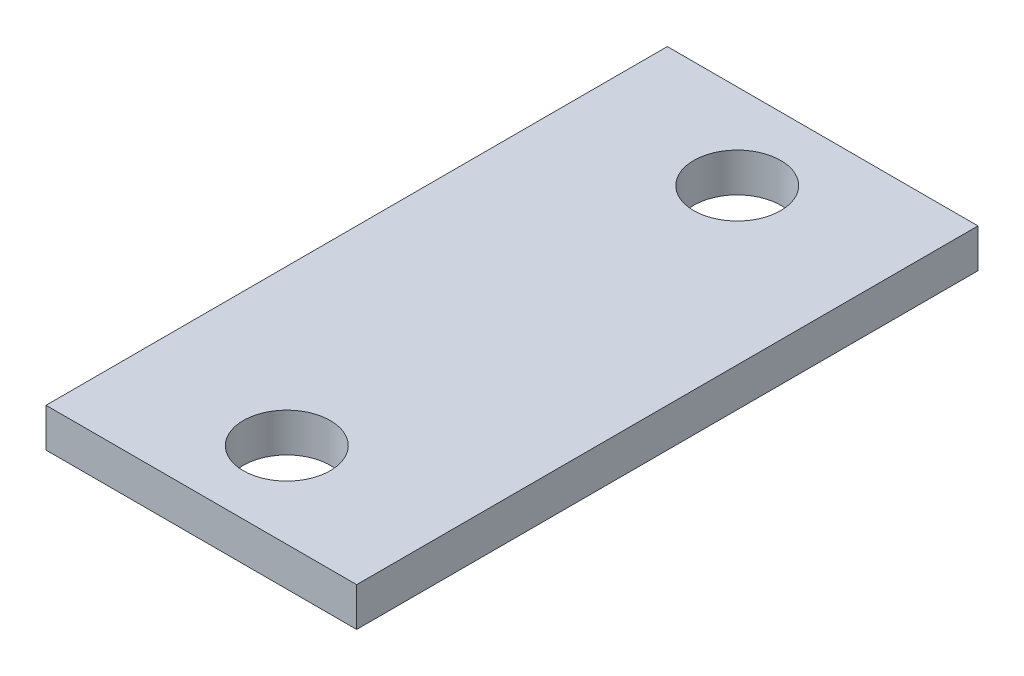
ISO-10303-21;
HEADER;
FILE_DESCRIPTION(('STEP AP214'),'2;1');
FILE_NAME('part.step','',(''),(''),'','','');
FILE_SCHEMA(('AUTOMOTIVE_DESIGN { 1 0 10303 214 1 1 1 1 }'));
ENDSEC;
DATA;
#1=APPLICATION_CONTEXT('core data for automotive mechanical design processes');
#2=APPLICATION_PROTOCOL_DEFINITION('international standard','automotive_design',2000,#1);
#3=PRODUCT_CONTEXT('',#1,'mechanical');
#4=PRODUCT('Part','Part','',(#3));
#5=PRODUCT_RELATED_PRODUCT_CATEGORY('part','',(#4));
#6=PRODUCT_DEFINITION_FORMATION('','',#4);
#7=PRODUCT_DEFINITION_CONTEXT('part definition',#1,'design');
#8=PRODUCT_DEFINITION('design','',#6,#7);
#9=PRODUCT_DEFINITION_SHAPE('','',#8);
#10=(LENGTH_UNIT() NAMED_UNIT(*) SI_UNIT(.MILLI.,.METRE.));
#11=(NAMED_UNIT(*) PLANE_ANGLE_UNIT() SI_UNIT($,.RADIAN.));
#12=(NAMED_UNIT(*) SI_UNIT($,.STERADIAN.) SOLID_ANGLE_UNIT());
#13=UNCERTAINTY_MEASURE_WITH_UNIT(LENGTH_MEASURE(1.E-05),#10,'distance_accuracy_value','');
#14=(GEOMETRIC_REPRESENTATION_CONTEXT(3) GLOBAL_UNCERTAINTY_ASSIGNED_CONTEXT((#13)) GLOBAL_UNIT_ASSIGNED_CONTEXT((#10,
#11,#12)) REPRESENTATION_CONTEXT('',''));
#15=CARTESIAN_POINT('',(0.,0.,0.));
#16=DIRECTION('',(0.,0.,1.));
#17=DIRECTION('',(1.,0.,0.));
#18=AXIS2_PLACEMENT_3D('',#15,#16,#17);
#19=CARTESIAN_POINT('',(0.,6.35000000000002,0.));
#20=DIRECTION('',(0.,-0.999999999999998,0.));
#21=DIRECTION('',(0.,0.,-1.));
#22=AXIS2_PLACEMENT_3D('',#19,#20,#21);
#23=PLANE('',#22);
#24=DIRECTION('',(0.,0.,1.));
#25=VECTOR('',#24,1.);
#26=CARTESIAN_POINT('',(0.,6.35000000000002,0.));
#27=LINE('',#26,#25);
#28=CARTESIAN_POINT('',(0.,6.35000000000002,-101.6));
#29=VERTEX_POINT('',#28);
#30=CARTESIAN_POINT('',(0.,6.35000000000002,0.));
#31=VERTEX_POINT('',#30);
#32=EDGE_CURVE('E94',#29,#31,#27,.T.);
#33=ORIENTED_EDGE('',*,*,#32,.T.);
#34=DIRECTION('',(1.,0.,0.));
#35=VECTOR('',#34,1.);
#36=CARTESIAN_POINT('',(0.,6.35000000000002,0.));
#37=LINE('',#36,#35);
#38=CARTESIAN_POINT('',(50.8,6.35000000000002,0.));
#39=VERTEX_POINT('',#38);
#40=EDGE_CURVE('E89',#31,#39,#37,.T.);
#41=ORIENTED_EDGE('',*,*,#40,.T.);
#42=DIRECTION('',(0.,0.,-1.));
#43=VECTOR('',#42,1.);
#44=CARTESIAN_POINT('',(50.8,6.35000000000002,0.));
#45=LINE('',#44,#43);
#46=CARTESIAN_POINT('',(50.8,6.35000000000002,-101.6));
#47=VERTEX_POINT('',#46);
#48=EDGE_CURVE('E92',#39,#47,#45,.T.);
#49=ORIENTED_EDGE('',*,*,#48,.T.);
#50=DIRECTION('',(-1.,0.,0.));
#51=VECTOR('',#50,1.);
#52=CARTESIAN_POINT('',(0.,6.35000000000002,-101.6));
#53=LINE('',#52,#51);
#54=EDGE_CURVE('E59',#47,#29,#53,.T.);
#55=ORIENTED_EDGE('',*,*,#54,.T.);
#56=EDGE_LOOP('',(#33,#41,#49,#55));
#57=FACE_BOUND('',#56,.T.);
#58=CARTESIAN_POINT('',(25.4,6.35000000000002,-13.97));
#59=DIRECTION('',(0.,0.999999999999998,0.));
#60=DIRECTION('',(0.,0.,1.));
#61=AXIS2_PLACEMENT_3D('',#58,#59,#60);
#62=CIRCLE('',#61,7.112);
#63=CARTESIAN_POINT('',(25.4,6.35000000000002,-6.85799999999998));
#64=VERTEX_POINT('',#63);
#65=EDGE_CURVE('E109',#64,#64,#62,.T.);
#66=ORIENTED_EDGE('',*,*,#65,.F.);
#67=EDGE_LOOP('',(#66));
#68=FACE_BOUND('',#67,.T.);
#69=CARTESIAN_POINT('',(25.4,6.35000000000002,-87.63));
#70=DIRECTION('',(0.,0.999999999999998,0.));
#71=DIRECTION('',(0.,0.,1.));
#72=AXIS2_PLACEMENT_3D('',#69,#70,#71);
#73=CIRCLE('',#72,7.112);
#74=CARTESIAN_POINT('',(25.4,6.35000000000002,-80.518));
#75=VERTEX_POINT('',#74);
#76=EDGE_CURVE('E124',#75,#75,#73,.T.);
#77=ORIENTED_EDGE('',*,*,#76,.F.);
#78=EDGE_LOOP('',(#77));
#79=FACE_BOUND('',#78,.T.);
#80=ADVANCED_FACE('F42',(#57,#68,#79),#23,.F.);
#81=CARTESIAN_POINT('',(0.,0.,0.));
#82=DIRECTION('',(0.,-0.999999999999998,0.));
#83=DIRECTION('',(0.,0.,-1.));
#84=AXIS2_PLACEMENT_3D('',#81,#82,#83);
#85=PLANE('',#84);
#86=CARTESIAN_POINT('',(25.4,0.,-13.97));
#87=DIRECTION('',(0.,0.999999999999998,0.));
#88=DIRECTION('',(0.,0.,1.));
#89=AXIS2_PLACEMENT_3D('',#86,#87,#88);
#90=CIRCLE('',#89,7.112);
#91=CARTESIAN_POINT('',(25.4,0.,-6.85799999999998));
#92=VERTEX_POINT('',#91);
#93=EDGE_CURVE('E121',#92,#92,#90,.T.);
#94=ORIENTED_EDGE('',*,*,#93,.T.);
#95=EDGE_LOOP('',(#94));
#96=FACE_BOUND('',#95,.T.);
#97=DIRECTION('',(0.,0.,1.));
#98=VECTOR('',#97,1.);
#99=CARTESIAN_POINT('',(0.,0.,0.));
#100=LINE('',#99,#98);
#101=CARTESIAN_POINT('',(0.,0.,-101.6));
#102=VERTEX_POINT('',#101);
#103=CARTESIAN_POINT('',(0.,0.,0.));
#104=VERTEX_POINT('',#103);
#105=EDGE_CURVE('E106',#102,#104,#100,.T.);
#106=ORIENTED_EDGE('',*,*,#105,.F.);
#107=DIRECTION('',(-1.,0.,0.));
#108=VECTOR('',#107,1.);
#109=CARTESIAN_POINT('',(0.,0.,-101.6));
#110=LINE('',#109,#108);
#111=CARTESIAN_POINT('',(50.8,0.,-101.6));
#112=VERTEX_POINT('',#111);
#113=EDGE_CURVE('E82',#112,#102,#110,.T.);
#114=ORIENTED_EDGE('',*,*,#113,.F.);
#115=DIRECTION('',(0.,0.,-1.));
#116=VECTOR('',#115,1.);
#117=CARTESIAN_POINT('',(50.8,0.,0.));
#118=LINE('',#117,#116);
#119=CARTESIAN_POINT('',(50.8,0.,0.));
#120=VERTEX_POINT('',#119);
#121=EDGE_CURVE('E76',#120,#112,#118,.T.);
#122=ORIENTED_EDGE('',*,*,#121,.F.);
#123=DIRECTION('',(1.,0.,0.));
#124=VECTOR('',#123,1.);
#125=CARTESIAN_POINT('',(0.,0.,0.));
#126=LINE('',#125,#124);
#127=EDGE_CURVE('E98',#104,#120,#126,.T.);
#128=ORIENTED_EDGE('',*,*,#127,.F.);
#129=EDGE_LOOP('',(#106,#114,#122,#128));
#130=FACE_BOUND('',#129,.T.);
#131=CARTESIAN_POINT('',(25.4,0.,-87.63));
#132=DIRECTION('',(0.,0.999999999999998,0.));
#133=DIRECTION('',(0.,0.,1.));
#134=AXIS2_PLACEMENT_3D('',#131,#132,#133);
#135=CIRCLE('',#134,7.112);
#136=CARTESIAN_POINT('',(25.4,0.,-80.518));
#137=VERTEX_POINT('',#136);
#138=EDGE_CURVE('E127',#137,#137,#135,.T.);
#139=ORIENTED_EDGE('',*,*,#138,.T.);
#140=EDGE_LOOP('',(#139));
#141=FACE_BOUND('',#140,.T.);
#142=ADVANCED_FACE('F117',(#96,#130,#141),#85,.T.);
#143=CARTESIAN_POINT('',(0.,6.35000000000002,0.));
#144=DIRECTION('',(1.,0.,0.));
#145=DIRECTION('',(0.,0.,-1.));
#146=AXIS2_PLACEMENT_3D('',#143,#144,#145);
#147=PLANE('',#146);
#148=ORIENTED_EDGE('',*,*,#105,.T.);
#149=DIRECTION('',(0.,-0.999999999999998,0.));
#150=VECTOR('',#149,1.);
#151=CARTESIAN_POINT('',(0.,6.35000000000002,0.));
#152=LINE('',#151,#150);
#153=EDGE_CURVE('E13',#31,#104,#152,.T.);
#154=ORIENTED_EDGE('',*,*,#153,.F.);
#155=ORIENTED_EDGE('',*,*,#32,.F.);
#156=DIRECTION('',(0.,-0.999999999999998,0.));
#157=VECTOR('',#156,1.);
#158=CARTESIAN_POINT('',(0.,6.35000000000002,-101.6));
#159=LINE('',#158,#157);
#160=EDGE_CURVE('E102',#29,#102,#159,.T.);
#161=ORIENTED_EDGE('',*,*,#160,.T.);
#162=EDGE_LOOP('',(#148,#154,#155,#161));
#163=FACE_BOUND('',#162,.T.);
#164=ADVANCED_FACE('F44',(#163),#147,.F.);
#165=CARTESIAN_POINT('',(0.,6.35000000000002,0.));
#166=DIRECTION('',(0.,0.,-1.));
#167=DIRECTION('',(-1.,0.,0.));
#168=AXIS2_PLACEMENT_3D('',#165,#166,#167);
#169=PLANE('',#168);
#170=ORIENTED_EDGE('',*,*,#127,.T.);
#171=DIRECTION('',(0.,-0.999999999999998,0.));
#172=VECTOR('',#171,1.);
#173=CARTESIAN_POINT('',(50.8,6.35000000000002,0.));
#174=LINE('',#173,#172);
#175=EDGE_CURVE('E51',#39,#120,#174,.T.);
#176=ORIENTED_EDGE('',*,*,#175,.F.);
#177=ORIENTED_EDGE('',*,*,#40,.F.);
#178=ORIENTED_EDGE('',*,*,#153,.T.);
#179=EDGE_LOOP('',(#170,#176,#177,#178));
#180=FACE_BOUND('',#179,.T.);
#181=ADVANCED_FACE('F97',(#180),#169,.F.);
#182=CARTESIAN_POINT('',(50.8,6.35000000000002,0.));
#183=DIRECTION('',(-1.,0.,0.));
#184=DIRECTION('',(0.,0.,1.));
#185=AXIS2_PLACEMENT_3D('',#182,#183,#184);
#186=PLANE('',#185);
#187=ORIENTED_EDGE('',*,*,#121,.T.);
#188=DIRECTION('',(0.,-0.999999999999998,0.));
#189=VECTOR('',#188,1.);
#190=CARTESIAN_POINT('',(50.8,6.35000000000002,-101.6));
#191=LINE('',#190,#189);
#192=EDGE_CURVE('E99',#47,#112,#191,.T.);
#193=ORIENTED_EDGE('',*,*,#192,.F.);
#194=ORIENTED_EDGE('',*,*,#48,.F.);
#195=ORIENTED_EDGE('',*,*,#175,.T.);
#196=EDGE_LOOP('',(#187,#193,#194,#195));
#197=FACE_BOUND('',#196,.T.);
#198=ADVANCED_FACE('F100',(#197),#186,.F.);
#199=CARTESIAN_POINT('',(0.,6.35000000000002,-101.6));
#200=DIRECTION('',(0.,0.,1.));
#201=DIRECTION('',(1.,0.,0.));
#202=AXIS2_PLACEMENT_3D('',#199,#200,#201);
#203=PLANE('',#202);
#204=ORIENTED_EDGE('',*,*,#113,.T.);
#205=ORIENTED_EDGE('',*,*,#160,.F.);
#206=ORIENTED_EDGE('',*,*,#54,.F.);
#207=ORIENTED_EDGE('',*,*,#192,.T.);
#208=EDGE_LOOP('',(#204,#205,#206,#207));
#209=FACE_BOUND('',#208,.T.);
#210=ADVANCED_FACE('F114',(#209),#203,.F.);
#211=CARTESIAN_POINT('',(25.4,6.35000000000002,-13.97));
#212=DIRECTION('',(0.,-0.999999999999998,0.));
#213=DIRECTION('',(0.,0.,-1.));
#214=AXIS2_PLACEMENT_3D('',#211,#212,#213);
#215=CYLINDRICAL_SURFACE('',#214,7.112);
#216=ORIENTED_EDGE('',*,*,#65,.T.);
#217=EDGE_LOOP('',(#216));
#218=FACE_BOUND('',#217,.T.);
#219=ORIENTED_EDGE('',*,*,#93,.F.);
#220=EDGE_LOOP('',(#219));
#221=FACE_BOUND('',#220,.T.);
#222=ADVANCED_FACE('F144',(#218,#221),#215,.F.);
#223=CARTESIAN_POINT('',(25.4,6.35000000000002,-87.63));
#224=DIRECTION('',(0.,-0.999999999999998,0.));
#225=DIRECTION('',(0.,0.,-1.));
#226=AXIS2_PLACEMENT_3D('',#223,#224,#225);
#227=CYLINDRICAL_SURFACE('',#226,7.112);
#228=ORIENTED_EDGE('',*,*,#76,.T.);
#229=EDGE_LOOP('',(#228));
#230=FACE_BOUND('',#229,.T.);
#231=ORIENTED_EDGE('',*,*,#138,.F.);
#232=EDGE_LOOP('',(#231));
#233=FACE_BOUND('',#232,.T.);
#234=ADVANCED_FACE('F133',(#230,#233),#227,.F.);
#235=CLOSED_SHELL('',(#80,#142,#164,#181,#198,#210,#222,#234));
#236=MANIFOLD_SOLID_BREP('B2',#235);
#237=ADVANCED_BREP_SHAPE_REPRESENTATION('',(#18,#236),#14);
#238=SHAPE_DEFINITION_REPRESENTATION(#9,#237);
ENDSEC;
END-ISO-10303-21;
